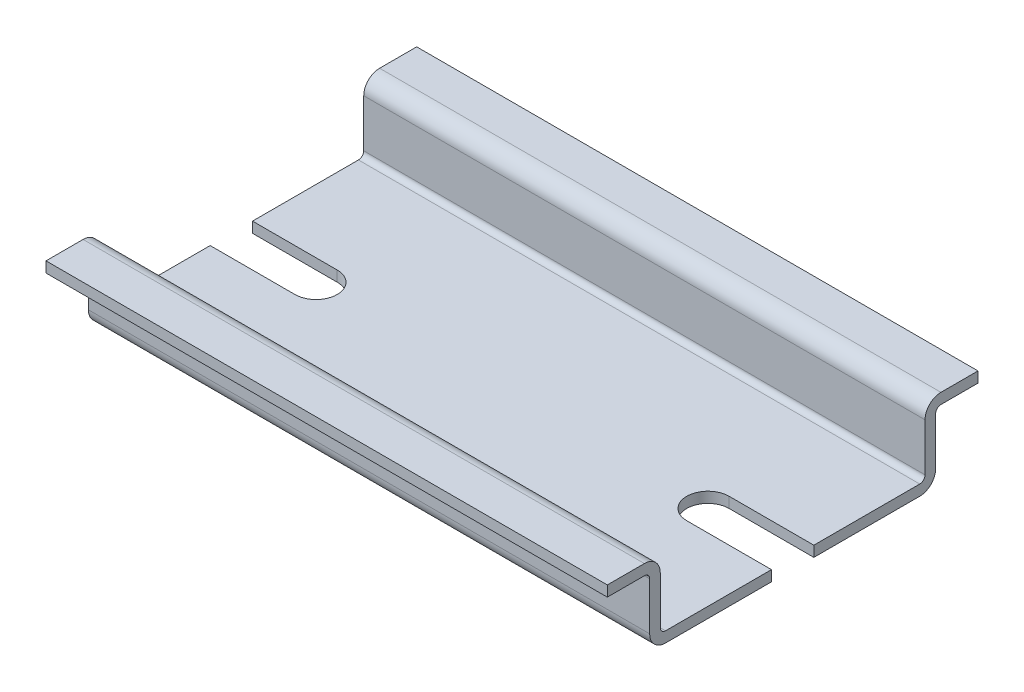
ISO-10303-21;
HEADER;
FILE_DESCRIPTION(('STEP AP214'),'2;1');
FILE_NAME('part.step','',(''),(''),'','','');
FILE_SCHEMA(('AUTOMOTIVE_DESIGN { 1 0 10303 214 1 1 1 1 }'));
ENDSEC;
DATA;
#1=APPLICATION_CONTEXT('core data for automotive mechanical design processes');
#2=APPLICATION_PROTOCOL_DEFINITION('international standard','automotive_design',2000,#1);
#3=PRODUCT_CONTEXT('',#1,'mechanical');
#4=PRODUCT('Part','Part','',(#3));
#5=PRODUCT_RELATED_PRODUCT_CATEGORY('part','',(#4));
#6=PRODUCT_DEFINITION_FORMATION('','',#4);
#7=PRODUCT_DEFINITION_CONTEXT('part definition',#1,'design');
#8=PRODUCT_DEFINITION('design','',#6,#7);
#9=PRODUCT_DEFINITION_SHAPE('','',#8);
#10=(LENGTH_UNIT() NAMED_UNIT(*) SI_UNIT(.MILLI.,.METRE.));
#11=(NAMED_UNIT(*) PLANE_ANGLE_UNIT() SI_UNIT($,.RADIAN.));
#12=(NAMED_UNIT(*) SI_UNIT($,.STERADIAN.) SOLID_ANGLE_UNIT());
#13=UNCERTAINTY_MEASURE_WITH_UNIT(LENGTH_MEASURE(1.E-05),#10,'distance_accuracy_value','');
#14=(GEOMETRIC_REPRESENTATION_CONTEXT(3) GLOBAL_UNCERTAINTY_ASSIGNED_CONTEXT((#13)) GLOBAL_UNIT_ASSIGNED_CONTEXT((#10,
#11,#12)) REPRESENTATION_CONTEXT('',''));
#15=CARTESIAN_POINT('',(0.,0.,0.));
#16=DIRECTION('',(0.,0.,1.));
#17=DIRECTION('',(1.,0.,0.));
#18=AXIS2_PLACEMENT_3D('',#15,#16,#17);
#19=CARTESIAN_POINT('',(26.5,0.,0.));
#20=DIRECTION('',(0.,1.,0.));
#21=DIRECTION('',(0.,0.,1.));
#22=AXIS2_PLACEMENT_3D('',#19,#20,#21);
#23=PLANE('',#22);
#24=DIRECTION('',(1.,0.,0.));
#25=VECTOR('',#24,1.);
#26=CARTESIAN_POINT('',(18.5,0.,-2.));
#27=LINE('',#26,#25);
#28=CARTESIAN_POINT('',(18.5,0.,-2.));
#29=VERTEX_POINT('',#28);
#30=CARTESIAN_POINT('',(26.5,0.,-2.));
#31=VERTEX_POINT('',#30);
#32=EDGE_CURVE('E55',#29,#31,#27,.T.);
#33=ORIENTED_EDGE('',*,*,#32,.F.);
#34=CARTESIAN_POINT('',(18.5,0.,0.));
#35=DIRECTION('',(0.,1.,0.));
#36=DIRECTION('',(0.,0.,1.));
#37=AXIS2_PLACEMENT_3D('',#34,#35,#36);
#38=CIRCLE('',#37,2.);
#39=CARTESIAN_POINT('',(18.5,0.,2.));
#40=VERTEX_POINT('',#39);
#41=EDGE_CURVE('E226',#29,#40,#38,.T.);
#42=ORIENTED_EDGE('',*,*,#41,.T.);
#43=DIRECTION('',(1.,0.,0.));
#44=VECTOR('',#43,1.);
#45=CARTESIAN_POINT('',(18.5,0.,2.));
#46=LINE('',#45,#44);
#47=CARTESIAN_POINT('',(26.5,0.,2.));
#48=VERTEX_POINT('',#47);
#49=EDGE_CURVE('E236',#40,#48,#46,.T.);
#50=ORIENTED_EDGE('',*,*,#49,.T.);
#51=DIRECTION('',(0.,0.,-1.));
#52=VECTOR('',#51,1.);
#53=CARTESIAN_POINT('',(26.5,0.,0.));
#54=LINE('',#53,#52);
#55=CARTESIAN_POINT('',(26.5,0.,12.));
#56=VERTEX_POINT('',#55);
#57=EDGE_CURVE('E454',#56,#48,#54,.T.);
#58=ORIENTED_EDGE('',*,*,#57,.F.);
#59=DIRECTION('',(-1.,0.,0.));
#60=VECTOR('',#59,1.);
#61=CARTESIAN_POINT('',(26.5,0.,12.));
#62=LINE('',#61,#60);
#63=CARTESIAN_POINT('',(-26.5,0.,12.));
#64=VERTEX_POINT('',#63);
#65=EDGE_CURVE('E11',#56,#64,#62,.T.);
#66=ORIENTED_EDGE('',*,*,#65,.T.);
#67=DIRECTION('',(0.,0.,-1.));
#68=VECTOR('',#67,1.);
#69=CARTESIAN_POINT('',(-26.5,0.,0.));
#70=LINE('',#69,#68);
#71=CARTESIAN_POINT('',(-26.5,0.,2.));
#72=VERTEX_POINT('',#71);
#73=EDGE_CURVE('E433',#64,#72,#70,.T.);
#74=ORIENTED_EDGE('',*,*,#73,.T.);
#75=DIRECTION('',(-1.,0.,0.));
#76=VECTOR('',#75,1.);
#77=CARTESIAN_POINT('',(-18.5,0.,2.));
#78=LINE('',#77,#76);
#79=CARTESIAN_POINT('',(-18.5,0.,2.));
#80=VERTEX_POINT('',#79);
#81=EDGE_CURVE('E375',#80,#72,#78,.T.);
#82=ORIENTED_EDGE('',*,*,#81,.F.);
#83=CARTESIAN_POINT('',(-18.5,0.,0.));
#84=DIRECTION('',(0.,-1.,0.));
#85=DIRECTION('',(0.,0.,1.));
#86=AXIS2_PLACEMENT_3D('',#83,#84,#85);
#87=CIRCLE('',#86,2.);
#88=CARTESIAN_POINT('',(-18.5,0.,-2.));
#89=VERTEX_POINT('',#88);
#90=EDGE_CURVE('E378',#89,#80,#87,.T.);
#91=ORIENTED_EDGE('',*,*,#90,.F.);
#92=DIRECTION('',(-1.,0.,0.));
#93=VECTOR('',#92,1.);
#94=CARTESIAN_POINT('',(-18.5,0.,-2.));
#95=LINE('',#94,#93);
#96=CARTESIAN_POINT('',(-26.5,0.,-2.));
#97=VERTEX_POINT('',#96);
#98=EDGE_CURVE('E296',#89,#97,#95,.T.);
#99=ORIENTED_EDGE('',*,*,#98,.T.);
#100=DIRECTION('',(0.,0.,1.));
#101=VECTOR('',#100,1.);
#102=CARTESIAN_POINT('',(-26.5,0.,0.));
#103=LINE('',#102,#101);
#104=CARTESIAN_POINT('',(-26.5,0.,-12.));
#105=VERTEX_POINT('',#104);
#106=EDGE_CURVE('E312',#105,#97,#103,.T.);
#107=ORIENTED_EDGE('',*,*,#106,.F.);
#108=DIRECTION('',(1.,0.,0.));
#109=VECTOR('',#108,1.);
#110=CARTESIAN_POINT('',(-26.5,0.,-12.));
#111=LINE('',#110,#109);
#112=CARTESIAN_POINT('',(26.5,0.,-12.));
#113=VERTEX_POINT('',#112);
#114=EDGE_CURVE('E371',#105,#113,#111,.T.);
#115=ORIENTED_EDGE('',*,*,#114,.T.);
#116=DIRECTION('',(0.,0.,1.));
#117=VECTOR('',#116,1.);
#118=CARTESIAN_POINT('',(26.5,0.,0.));
#119=LINE('',#118,#117);
#120=EDGE_CURVE('E248',#113,#31,#119,.T.);
#121=ORIENTED_EDGE('',*,*,#120,.T.);
#122=EDGE_LOOP('',(#33,#42,#50,#58,#66,#74,#82,#91,#99,#107,#115,#121));
#123=FACE_BOUND('',#122,.T.);
#124=ADVANCED_FACE('F39',(#123),#23,.F.);
#125=CARTESIAN_POINT('',(26.5,0.999999999999996,12.));
#126=DIRECTION('',(0.,-1.,0.));
#127=DIRECTION('',(0.,0.,-1.));
#128=AXIS2_PLACEMENT_3D('',#125,#126,#127);
#129=PLANE('',#128);
#130=CARTESIAN_POINT('',(18.5,0.999999999999995,0.));
#131=DIRECTION('',(0.,1.,0.));
#132=DIRECTION('',(0.,0.,1.));
#133=AXIS2_PLACEMENT_3D('',#130,#131,#132);
#134=CIRCLE('',#133,2.);
#135=CARTESIAN_POINT('',(18.5,0.999999999999995,-2.));
#136=VERTEX_POINT('',#135);
#137=CARTESIAN_POINT('',(18.5,0.999999999999995,2.));
#138=VERTEX_POINT('',#137);
#139=EDGE_CURVE('E436',#136,#138,#134,.T.);
#140=ORIENTED_EDGE('',*,*,#139,.F.);
#141=DIRECTION('',(1.,0.,0.));
#142=VECTOR('',#141,1.);
#143=CARTESIAN_POINT('',(18.5,0.999999999999995,-2.));
#144=LINE('',#143,#142);
#145=CARTESIAN_POINT('',(26.5,0.999999999999995,-2.));
#146=VERTEX_POINT('',#145);
#147=EDGE_CURVE('E241',#136,#146,#144,.T.);
#148=ORIENTED_EDGE('',*,*,#147,.T.);
#149=DIRECTION('',(0.,0.,-1.));
#150=VECTOR('',#149,1.);
#151=CARTESIAN_POINT('',(26.5,0.999999999999996,-12.));
#152=LINE('',#151,#150);
#153=CARTESIAN_POINT('',(26.5,0.999999999999996,-12.));
#154=VERTEX_POINT('',#153);
#155=EDGE_CURVE('E291',#146,#154,#152,.T.);
#156=ORIENTED_EDGE('',*,*,#155,.T.);
#157=DIRECTION('',(1.,0.,0.));
#158=VECTOR('',#157,1.);
#159=CARTESIAN_POINT('',(-26.5,0.999999999999996,-12.));
#160=LINE('',#159,#158);
#161=CARTESIAN_POINT('',(-26.5,0.999999999999996,-12.));
#162=VERTEX_POINT('',#161);
#163=EDGE_CURVE('E367',#162,#154,#160,.T.);
#164=ORIENTED_EDGE('',*,*,#163,.F.);
#165=DIRECTION('',(0.,0.,-1.));
#166=VECTOR('',#165,1.);
#167=CARTESIAN_POINT('',(-26.5,0.999999999999996,-12.));
#168=LINE('',#167,#166);
#169=CARTESIAN_POINT('',(-26.5,0.999999999999995,-2.));
#170=VERTEX_POINT('',#169);
#171=EDGE_CURVE('E316',#170,#162,#168,.T.);
#172=ORIENTED_EDGE('',*,*,#171,.F.);
#173=DIRECTION('',(-1.,0.,0.));
#174=VECTOR('',#173,1.);
#175=CARTESIAN_POINT('',(-18.5,0.999999999999995,-2.));
#176=LINE('',#175,#174);
#177=CARTESIAN_POINT('',(-18.5,0.999999999999995,-2.));
#178=VERTEX_POINT('',#177);
#179=EDGE_CURVE('E63',#178,#170,#176,.T.);
#180=ORIENTED_EDGE('',*,*,#179,.F.);
#181=CARTESIAN_POINT('',(-18.5,0.999999999999995,0.));
#182=DIRECTION('',(0.,-1.,0.));
#183=DIRECTION('',(0.,0.,1.));
#184=AXIS2_PLACEMENT_3D('',#181,#182,#183);
#185=CIRCLE('',#184,2.);
#186=CARTESIAN_POINT('',(-18.5,0.999999999999995,2.));
#187=VERTEX_POINT('',#186);
#188=EDGE_CURVE('E379',#178,#187,#185,.T.);
#189=ORIENTED_EDGE('',*,*,#188,.T.);
#190=DIRECTION('',(-1.,0.,0.));
#191=VECTOR('',#190,1.);
#192=CARTESIAN_POINT('',(-18.5,0.999999999999995,2.));
#193=LINE('',#192,#191);
#194=CARTESIAN_POINT('',(-26.5,0.999999999999995,2.));
#195=VERTEX_POINT('',#194);
#196=EDGE_CURVE('E374',#187,#195,#193,.T.);
#197=ORIENTED_EDGE('',*,*,#196,.T.);
#198=DIRECTION('',(0.,0.,1.));
#199=VECTOR('',#198,1.);
#200=CARTESIAN_POINT('',(-26.5,0.999999999999996,12.));
#201=LINE('',#200,#199);
#202=CARTESIAN_POINT('',(-26.5,0.999999999999996,12.));
#203=VERTEX_POINT('',#202);
#204=EDGE_CURVE('E430',#195,#203,#201,.T.);
#205=ORIENTED_EDGE('',*,*,#204,.T.);
#206=DIRECTION('',(-1.,0.,0.));
#207=VECTOR('',#206,1.);
#208=CARTESIAN_POINT('',(26.5,0.999999999999996,12.));
#209=LINE('',#208,#207);
#210=CARTESIAN_POINT('',(26.5,0.999999999999996,12.));
#211=VERTEX_POINT('',#210);
#212=EDGE_CURVE('E48',#211,#203,#209,.T.);
#213=ORIENTED_EDGE('',*,*,#212,.F.);
#214=DIRECTION('',(0.,0.,1.));
#215=VECTOR('',#214,1.);
#216=CARTESIAN_POINT('',(26.5,0.999999999999996,12.));
#217=LINE('',#216,#215);
#218=CARTESIAN_POINT('',(26.5,0.999999999999995,2.));
#219=VERTEX_POINT('',#218);
#220=EDGE_CURVE('E458',#219,#211,#217,.T.);
#221=ORIENTED_EDGE('',*,*,#220,.F.);
#222=DIRECTION('',(1.,0.,0.));
#223=VECTOR('',#222,1.);
#224=CARTESIAN_POINT('',(18.5,0.999999999999995,2.));
#225=LINE('',#224,#223);
#226=EDGE_CURVE('E237',#138,#219,#225,.T.);
#227=ORIENTED_EDGE('',*,*,#226,.F.);
#228=EDGE_LOOP('',(#140,#148,#156,#164,#172,#180,#189,#197,#205,#213,#221,#227));
#229=FACE_BOUND('',#228,.T.);
#230=ADVANCED_FACE('F534',(#229),#129,.F.);
#231=CARTESIAN_POINT('',(26.5,1.5,-12.));
#232=DIRECTION('',(-1.,0.,0.));
#233=DIRECTION('',(0.,0.,-1.));
#234=AXIS2_PLACEMENT_3D('',#231,#232,#233);
#235=PLANE('',#234);
#236=DIRECTION('',(0.,1.,0.));
#237=VECTOR('',#236,1.);
#238=CARTESIAN_POINT('',(26.5,0.,-2.));
#239=LINE('',#238,#237);
#240=EDGE_CURVE('E244',#31,#146,#239,.T.);
#241=ORIENTED_EDGE('',*,*,#240,.F.);
#242=ORIENTED_EDGE('',*,*,#120,.F.);
#243=CARTESIAN_POINT('',(26.5,1.5,-12.));
#244=DIRECTION('',(-1.,0.,0.));
#245=DIRECTION('',(0.,0.,-1.));
#246=AXIS2_PLACEMENT_3D('',#243,#244,#245);
#247=CIRCLE('',#246,1.5);
#248=CARTESIAN_POINT('',(26.5,1.5,-13.5));
#249=VERTEX_POINT('',#248);
#250=EDGE_CURVE('E243',#249,#113,#247,.T.);
#251=ORIENTED_EDGE('',*,*,#250,.F.);
#252=DIRECTION('',(0.,-1.,0.));
#253=VECTOR('',#252,1.);
#254=CARTESIAN_POINT('',(26.5,1.5,-13.5));
#255=LINE('',#254,#253);
#256=CARTESIAN_POINT('',(26.5,6.,-13.5));
#257=VERTEX_POINT('',#256);
#258=EDGE_CURVE('E259',#257,#249,#255,.T.);
#259=ORIENTED_EDGE('',*,*,#258,.F.);
#260=CARTESIAN_POINT('',(26.5,6.,-14.));
#261=DIRECTION('',(1.,0.,0.));
#262=DIRECTION('',(0.,0.,1.));
#263=AXIS2_PLACEMENT_3D('',#260,#261,#262);
#264=CIRCLE('',#263,0.5);
#265=CARTESIAN_POINT('',(26.5,6.5,-14.));
#266=VERTEX_POINT('',#265);
#267=EDGE_CURVE('E263',#266,#257,#264,.T.);
#268=ORIENTED_EDGE('',*,*,#267,.F.);
#269=DIRECTION('',(0.,0.,1.));
#270=VECTOR('',#269,1.);
#271=CARTESIAN_POINT('',(26.5,6.5,-14.));
#272=LINE('',#271,#270);
#273=CARTESIAN_POINT('',(26.5,6.5,-17.5));
#274=VERTEX_POINT('',#273);
#275=EDGE_CURVE('E267',#274,#266,#272,.T.);
#276=ORIENTED_EDGE('',*,*,#275,.F.);
#277=DIRECTION('',(0.,-1.,0.));
#278=VECTOR('',#277,1.);
#279=CARTESIAN_POINT('',(26.5,6.5,-17.5));
#280=LINE('',#279,#278);
#281=CARTESIAN_POINT('',(26.5,7.5,-17.5));
#282=VERTEX_POINT('',#281);
#283=EDGE_CURVE('E271',#282,#274,#280,.T.);
#284=ORIENTED_EDGE('',*,*,#283,.F.);
#285=DIRECTION('',(0.,0.,-1.));
#286=VECTOR('',#285,1.);
#287=CARTESIAN_POINT('',(26.5,7.5,-14.));
#288=LINE('',#287,#286);
#289=CARTESIAN_POINT('',(26.5,7.5,-14.));
#290=VERTEX_POINT('',#289);
#291=EDGE_CURVE('E275',#290,#282,#288,.T.);
#292=ORIENTED_EDGE('',*,*,#291,.F.);
#293=CARTESIAN_POINT('',(26.5,6.,-14.));
#294=DIRECTION('',(-1.,0.,0.));
#295=DIRECTION('',(0.,0.,1.));
#296=AXIS2_PLACEMENT_3D('',#293,#294,#295);
#297=CIRCLE('',#296,1.5);
#298=CARTESIAN_POINT('',(26.5,6.,-12.5));
#299=VERTEX_POINT('',#298);
#300=EDGE_CURVE('E279',#299,#290,#297,.T.);
#301=ORIENTED_EDGE('',*,*,#300,.F.);
#302=DIRECTION('',(0.,1.,0.));
#303=VECTOR('',#302,1.);
#304=CARTESIAN_POINT('',(26.5,1.5,-12.5));
#305=LINE('',#304,#303);
#306=CARTESIAN_POINT('',(26.5,1.5,-12.5));
#307=VERTEX_POINT('',#306);
#308=EDGE_CURVE('E283',#307,#299,#305,.T.);
#309=ORIENTED_EDGE('',*,*,#308,.F.);
#310=CARTESIAN_POINT('',(26.5,1.5,-12.));
#311=DIRECTION('',(1.,0.,0.));
#312=DIRECTION('',(0.,0.,1.));
#313=AXIS2_PLACEMENT_3D('',#310,#311,#312);
#314=CIRCLE('',#313,0.5);
#315=EDGE_CURVE('E287',#154,#307,#314,.T.);
#316=ORIENTED_EDGE('',*,*,#315,.F.);
#317=ORIENTED_EDGE('',*,*,#155,.F.);
#318=EDGE_LOOP('',(#241,#242,#251,#259,#268,#276,#284,#292,#301,#309,#316,#317));
#319=FACE_BOUND('',#318,.T.);
#320=ADVANCED_FACE('F567',(#319),#235,.F.);
#321=CARTESIAN_POINT('',(-26.5,1.5,12.));
#322=DIRECTION('',(1.,0.,0.));
#323=DIRECTION('',(0.,0.,1.));
#324=AXIS2_PLACEMENT_3D('',#321,#322,#323);
#325=PLANE('',#324);
#326=DIRECTION('',(0.,1.,0.));
#327=VECTOR('',#326,1.);
#328=CARTESIAN_POINT('',(-26.5,0.,2.));
#329=LINE('',#328,#327);
#330=EDGE_CURVE('E382',#72,#195,#329,.T.);
#331=ORIENTED_EDGE('',*,*,#330,.F.);
#332=ORIENTED_EDGE('',*,*,#73,.F.);
#333=CARTESIAN_POINT('',(-26.5,1.5,12.));
#334=DIRECTION('',(1.,0.,0.));
#335=DIRECTION('',(0.,0.,1.));
#336=AXIS2_PLACEMENT_3D('',#333,#334,#335);
#337=CIRCLE('',#336,1.5);
#338=CARTESIAN_POINT('',(-26.5,1.5,13.5));
#339=VERTEX_POINT('',#338);
#340=EDGE_CURVE('E392',#339,#64,#337,.T.);
#341=ORIENTED_EDGE('',*,*,#340,.F.);
#342=DIRECTION('',(0.,-1.,0.));
#343=VECTOR('',#342,1.);
#344=CARTESIAN_POINT('',(-26.5,1.5,13.5));
#345=LINE('',#344,#343);
#346=CARTESIAN_POINT('',(-26.5,6.,13.5));
#347=VERTEX_POINT('',#346);
#348=EDGE_CURVE('E398',#347,#339,#345,.T.);
#349=ORIENTED_EDGE('',*,*,#348,.F.);
#350=CARTESIAN_POINT('',(-26.5,6.,14.));
#351=DIRECTION('',(-1.,0.,0.));
#352=DIRECTION('',(0.,0.,-1.));
#353=AXIS2_PLACEMENT_3D('',#350,#351,#352);
#354=CIRCLE('',#353,0.5);
#355=CARTESIAN_POINT('',(-26.5,6.5,14.));
#356=VERTEX_POINT('',#355);
#357=EDGE_CURVE('E402',#356,#347,#354,.T.);
#358=ORIENTED_EDGE('',*,*,#357,.F.);
#359=DIRECTION('',(0.,0.,-1.));
#360=VECTOR('',#359,1.);
#361=CARTESIAN_POINT('',(-26.5,6.5,14.));
#362=LINE('',#361,#360);
#363=CARTESIAN_POINT('',(-26.5,6.5,17.5));
#364=VERTEX_POINT('',#363);
#365=EDGE_CURVE('E406',#364,#356,#362,.T.);
#366=ORIENTED_EDGE('',*,*,#365,.F.);
#367=DIRECTION('',(0.,-1.,0.));
#368=VECTOR('',#367,1.);
#369=CARTESIAN_POINT('',(-26.5,6.5,17.5));
#370=LINE('',#369,#368);
#371=CARTESIAN_POINT('',(-26.5,7.5,17.5));
#372=VERTEX_POINT('',#371);
#373=EDGE_CURVE('E410',#372,#364,#370,.T.);
#374=ORIENTED_EDGE('',*,*,#373,.F.);
#375=DIRECTION('',(0.,0.,1.));
#376=VECTOR('',#375,1.);
#377=CARTESIAN_POINT('',(-26.5,7.5,14.));
#378=LINE('',#377,#376);
#379=CARTESIAN_POINT('',(-26.5,7.5,14.));
#380=VERTEX_POINT('',#379);
#381=EDGE_CURVE('E414',#380,#372,#378,.T.);
#382=ORIENTED_EDGE('',*,*,#381,.F.);
#383=CARTESIAN_POINT('',(-26.5,6.,14.));
#384=DIRECTION('',(1.,0.,0.));
#385=DIRECTION('',(0.,0.,-1.));
#386=AXIS2_PLACEMENT_3D('',#383,#384,#385);
#387=CIRCLE('',#386,1.5);
#388=CARTESIAN_POINT('',(-26.5,6.,12.5));
#389=VERTEX_POINT('',#388);
#390=EDGE_CURVE('E418',#389,#380,#387,.T.);
#391=ORIENTED_EDGE('',*,*,#390,.F.);
#392=DIRECTION('',(0.,1.,0.));
#393=VECTOR('',#392,1.);
#394=CARTESIAN_POINT('',(-26.5,1.5,12.5));
#395=LINE('',#394,#393);
#396=CARTESIAN_POINT('',(-26.5,1.5,12.5));
#397=VERTEX_POINT('',#396);
#398=EDGE_CURVE('E422',#397,#389,#395,.T.);
#399=ORIENTED_EDGE('',*,*,#398,.F.);
#400=CARTESIAN_POINT('',(-26.5,1.5,12.));
#401=DIRECTION('',(-1.,0.,0.));
#402=DIRECTION('',(0.,0.,-1.));
#403=AXIS2_PLACEMENT_3D('',#400,#401,#402);
#404=CIRCLE('',#403,0.5);
#405=EDGE_CURVE('E426',#203,#397,#404,.T.);
#406=ORIENTED_EDGE('',*,*,#405,.F.);
#407=ORIENTED_EDGE('',*,*,#204,.F.);
#408=EDGE_LOOP('',(#331,#332,#341,#349,#358,#366,#374,#382,#391,#399,#406,#407));
#409=FACE_BOUND('',#408,.T.);
#410=ADVANCED_FACE('F522',(#409),#325,.F.);
#411=CARTESIAN_POINT('',(26.5,1.5,12.));
#412=DIRECTION('',(-1.,0.,0.));
#413=DIRECTION('',(0.,0.,1.));
#414=AXIS2_PLACEMENT_3D('',#411,#412,#413);
#415=CYLINDRICAL_SURFACE('',#414,1.5);
#416=DIRECTION('',(-1.,0.,0.));
#417=VECTOR('',#416,1.);
#418=CARTESIAN_POINT('',(26.5,1.5,13.5));
#419=LINE('',#418,#417);
#420=CARTESIAN_POINT('',(26.5,1.5,13.5));
#421=VERTEX_POINT('',#420);
#422=EDGE_CURVE('E485',#421,#339,#419,.T.);
#423=ORIENTED_EDGE('',*,*,#422,.T.);
#424=ORIENTED_EDGE('',*,*,#340,.T.);
#425=ORIENTED_EDGE('',*,*,#65,.F.);
#426=CARTESIAN_POINT('',(26.5,1.5,12.));
#427=DIRECTION('',(1.,0.,0.));
#428=DIRECTION('',(0.,0.,1.));
#429=AXIS2_PLACEMENT_3D('',#426,#427,#428);
#430=CIRCLE('',#429,1.5);
#431=EDGE_CURVE('E448',#421,#56,#430,.T.);
#432=ORIENTED_EDGE('',*,*,#431,.F.);
#433=EDGE_LOOP('',(#423,#424,#425,#432));
#434=FACE_BOUND('',#433,.T.);
#435=ADVANCED_FACE('F41',(#434),#415,.T.);
#436=CARTESIAN_POINT('',(26.5,1.5,12.));
#437=DIRECTION('',(-1.,0.,0.));
#438=DIRECTION('',(0.,0.,1.));
#439=AXIS2_PLACEMENT_3D('',#436,#437,#438);
#440=CYLINDRICAL_SURFACE('',#439,0.5);
#441=ORIENTED_EDGE('',*,*,#212,.T.);
#442=ORIENTED_EDGE('',*,*,#405,.T.);
#443=DIRECTION('',(-1.,0.,0.));
#444=VECTOR('',#443,1.);
#445=CARTESIAN_POINT('',(26.5,1.5,12.5));
#446=LINE('',#445,#444);
#447=CARTESIAN_POINT('',(26.5,1.5,12.5));
#448=VERTEX_POINT('',#447);
#449=EDGE_CURVE('E506',#448,#397,#446,.T.);
#450=ORIENTED_EDGE('',*,*,#449,.F.);
#451=CARTESIAN_POINT('',(26.5,1.5,12.));
#452=DIRECTION('',(-1.,0.,0.));
#453=DIRECTION('',(0.,0.,-1.));
#454=AXIS2_PLACEMENT_3D('',#451,#452,#453);
#455=CIRCLE('',#454,0.5);
#456=EDGE_CURVE('E461',#211,#448,#455,.T.);
#457=ORIENTED_EDGE('',*,*,#456,.F.);
#458=EDGE_LOOP('',(#441,#442,#450,#457));
#459=FACE_BOUND('',#458,.T.);
#460=ADVANCED_FACE('F514',(#459),#440,.F.);
#461=CARTESIAN_POINT('',(26.5,1.5,12.5));
#462=DIRECTION('',(0.,0.,1.));
#463=DIRECTION('',(0.,-1.,0.));
#464=AXIS2_PLACEMENT_3D('',#461,#462,#463);
#465=PLANE('',#464);
#466=ORIENTED_EDGE('',*,*,#449,.T.);
#467=ORIENTED_EDGE('',*,*,#398,.T.);
#468=DIRECTION('',(-1.,0.,0.));
#469=VECTOR('',#468,1.);
#470=CARTESIAN_POINT('',(26.5,6.,12.5));
#471=LINE('',#470,#469);
#472=CARTESIAN_POINT('',(26.5,6.,12.5));
#473=VERTEX_POINT('',#472);
#474=EDGE_CURVE('E503',#473,#389,#471,.T.);
#475=ORIENTED_EDGE('',*,*,#474,.F.);
#476=DIRECTION('',(0.,1.,0.));
#477=VECTOR('',#476,1.);
#478=CARTESIAN_POINT('',(26.5,1.5,12.5));
#479=LINE('',#478,#477);
#480=EDGE_CURVE('E464',#448,#473,#479,.T.);
#481=ORIENTED_EDGE('',*,*,#480,.F.);
#482=EDGE_LOOP('',(#466,#467,#475,#481));
#483=FACE_BOUND('',#482,.T.);
#484=ADVANCED_FACE('F527',(#483),#465,.F.);
#485=CARTESIAN_POINT('',(26.5,6.,14.));
#486=DIRECTION('',(-1.,0.,0.));
#487=DIRECTION('',(0.,0.,1.));
#488=AXIS2_PLACEMENT_3D('',#485,#486,#487);
#489=CYLINDRICAL_SURFACE('',#488,1.5);
#490=ORIENTED_EDGE('',*,*,#474,.T.);
#491=ORIENTED_EDGE('',*,*,#390,.T.);
#492=DIRECTION('',(-1.,0.,0.));
#493=VECTOR('',#492,1.);
#494=CARTESIAN_POINT('',(26.5,7.5,14.));
#495=LINE('',#494,#493);
#496=CARTESIAN_POINT('',(26.5,7.5,14.));
#497=VERTEX_POINT('',#496);
#498=EDGE_CURVE('E500',#497,#380,#495,.T.);
#499=ORIENTED_EDGE('',*,*,#498,.F.);
#500=CARTESIAN_POINT('',(26.5,6.,14.));
#501=DIRECTION('',(1.,0.,0.));
#502=DIRECTION('',(0.,0.,-1.));
#503=AXIS2_PLACEMENT_3D('',#500,#501,#502);
#504=CIRCLE('',#503,1.5);
#505=EDGE_CURVE('E467',#473,#497,#504,.T.);
#506=ORIENTED_EDGE('',*,*,#505,.F.);
#507=EDGE_LOOP('',(#490,#491,#499,#506));
#508=FACE_BOUND('',#507,.T.);
#509=ADVANCED_FACE('F625',(#508),#489,.T.);
#510=CARTESIAN_POINT('',(26.5,7.5,14.));
#511=DIRECTION('',(0.,-1.,0.));
#512=DIRECTION('',(0.,0.,-1.));
#513=AXIS2_PLACEMENT_3D('',#510,#511,#512);
#514=PLANE('',#513);
#515=ORIENTED_EDGE('',*,*,#498,.T.);
#516=ORIENTED_EDGE('',*,*,#381,.T.);
#517=DIRECTION('',(-1.,0.,0.));
#518=VECTOR('',#517,1.);
#519=CARTESIAN_POINT('',(26.5,7.5,17.5));
#520=LINE('',#519,#518);
#521=CARTESIAN_POINT('',(26.5,7.5,17.5));
#522=VERTEX_POINT('',#521);
#523=EDGE_CURVE('E497',#522,#372,#520,.T.);
#524=ORIENTED_EDGE('',*,*,#523,.F.);
#525=DIRECTION('',(0.,0.,1.));
#526=VECTOR('',#525,1.);
#527=CARTESIAN_POINT('',(26.5,7.5,14.));
#528=LINE('',#527,#526);
#529=EDGE_CURVE('E470',#497,#522,#528,.T.);
#530=ORIENTED_EDGE('',*,*,#529,.F.);
#531=EDGE_LOOP('',(#515,#516,#524,#530));
#532=FACE_BOUND('',#531,.T.);
#533=ADVANCED_FACE('F628',(#532),#514,.F.);
#534=CARTESIAN_POINT('',(26.5,6.5,17.5));
#535=DIRECTION('',(0.,0.,-1.));
#536=DIRECTION('',(0.,1.,0.));
#537=AXIS2_PLACEMENT_3D('',#534,#535,#536);
#538=PLANE('',#537);
#539=ORIENTED_EDGE('',*,*,#523,.T.);
#540=ORIENTED_EDGE('',*,*,#373,.T.);
#541=DIRECTION('',(-1.,0.,0.));
#542=VECTOR('',#541,1.);
#543=CARTESIAN_POINT('',(26.5,6.5,17.5));
#544=LINE('',#543,#542);
#545=CARTESIAN_POINT('',(26.5,6.5,17.5));
#546=VERTEX_POINT('',#545);
#547=EDGE_CURVE('E494',#546,#364,#544,.T.);
#548=ORIENTED_EDGE('',*,*,#547,.F.);
#549=DIRECTION('',(0.,-1.,0.));
#550=VECTOR('',#549,1.);
#551=CARTESIAN_POINT('',(26.5,6.5,17.5));
#552=LINE('',#551,#550);
#553=EDGE_CURVE('E473',#522,#546,#552,.T.);
#554=ORIENTED_EDGE('',*,*,#553,.F.);
#555=EDGE_LOOP('',(#539,#540,#548,#554));
#556=FACE_BOUND('',#555,.T.);
#557=ADVANCED_FACE('F632',(#556),#538,.F.);
#558=CARTESIAN_POINT('',(26.5,6.5,14.));
#559=DIRECTION('',(0.,1.,0.));
#560=DIRECTION('',(0.,0.,1.));
#561=AXIS2_PLACEMENT_3D('',#558,#559,#560);
#562=PLANE('',#561);
#563=ORIENTED_EDGE('',*,*,#547,.T.);
#564=ORIENTED_EDGE('',*,*,#365,.T.);
#565=DIRECTION('',(-1.,0.,0.));
#566=VECTOR('',#565,1.);
#567=CARTESIAN_POINT('',(26.5,6.5,14.));
#568=LINE('',#567,#566);
#569=CARTESIAN_POINT('',(26.5,6.5,14.));
#570=VERTEX_POINT('',#569);
#571=EDGE_CURVE('E491',#570,#356,#568,.T.);
#572=ORIENTED_EDGE('',*,*,#571,.F.);
#573=DIRECTION('',(0.,0.,-1.));
#574=VECTOR('',#573,1.);
#575=CARTESIAN_POINT('',(26.5,6.5,14.));
#576=LINE('',#575,#574);
#577=EDGE_CURVE('E476',#546,#570,#576,.T.);
#578=ORIENTED_EDGE('',*,*,#577,.F.);
#579=EDGE_LOOP('',(#563,#564,#572,#578));
#580=FACE_BOUND('',#579,.T.);
#581=ADVANCED_FACE('F636',(#580),#562,.F.);
#582=CARTESIAN_POINT('',(26.5,6.,14.));
#583=DIRECTION('',(-1.,0.,0.));
#584=DIRECTION('',(0.,0.,1.));
#585=AXIS2_PLACEMENT_3D('',#582,#583,#584);
#586=CYLINDRICAL_SURFACE('',#585,0.5);
#587=ORIENTED_EDGE('',*,*,#571,.T.);
#588=ORIENTED_EDGE('',*,*,#357,.T.);
#589=DIRECTION('',(-1.,0.,0.));
#590=VECTOR('',#589,1.);
#591=CARTESIAN_POINT('',(26.5,6.,13.5));
#592=LINE('',#591,#590);
#593=CARTESIAN_POINT('',(26.5,6.,13.5));
#594=VERTEX_POINT('',#593);
#595=EDGE_CURVE('E488',#594,#347,#592,.T.);
#596=ORIENTED_EDGE('',*,*,#595,.F.);
#597=CARTESIAN_POINT('',(26.5,6.,14.));
#598=DIRECTION('',(-1.,0.,0.));
#599=DIRECTION('',(0.,0.,-1.));
#600=AXIS2_PLACEMENT_3D('',#597,#598,#599);
#601=CIRCLE('',#600,0.5);
#602=EDGE_CURVE('E479',#570,#594,#601,.T.);
#603=ORIENTED_EDGE('',*,*,#602,.F.);
#604=EDGE_LOOP('',(#587,#588,#596,#603));
#605=FACE_BOUND('',#604,.T.);
#606=ADVANCED_FACE('F640',(#605),#586,.F.);
#607=CARTESIAN_POINT('',(26.5,1.5,13.5));
#608=DIRECTION('',(0.,0.,-1.));
#609=DIRECTION('',(0.,1.,0.));
#610=AXIS2_PLACEMENT_3D('',#607,#608,#609);
#611=PLANE('',#610);
#612=ORIENTED_EDGE('',*,*,#595,.T.);
#613=ORIENTED_EDGE('',*,*,#348,.T.);
#614=ORIENTED_EDGE('',*,*,#422,.F.);
#615=DIRECTION('',(0.,-1.,0.));
#616=VECTOR('',#615,1.);
#617=CARTESIAN_POINT('',(26.5,1.5,13.5));
#618=LINE('',#617,#616);
#619=EDGE_CURVE('E482',#594,#421,#618,.T.);
#620=ORIENTED_EDGE('',*,*,#619,.F.);
#621=EDGE_LOOP('',(#612,#613,#614,#620));
#622=FACE_BOUND('',#621,.T.);
#623=ADVANCED_FACE('F644',(#622),#611,.F.);
#624=CARTESIAN_POINT('',(26.5,1.5,12.));
#625=DIRECTION('',(-1.,0.,0.));
#626=DIRECTION('',(0.,0.,1.));
#627=AXIS2_PLACEMENT_3D('',#624,#625,#626);
#628=PLANE('',#627);
#629=ORIENTED_EDGE('',*,*,#57,.T.);
#630=DIRECTION('',(0.,1.,0.));
#631=VECTOR('',#630,1.);
#632=CARTESIAN_POINT('',(26.5,0.,2.));
#633=LINE('',#632,#631);
#634=EDGE_CURVE('E444',#48,#219,#633,.T.);
#635=ORIENTED_EDGE('',*,*,#634,.T.);
#636=ORIENTED_EDGE('',*,*,#220,.T.);
#637=ORIENTED_EDGE('',*,*,#456,.T.);
#638=ORIENTED_EDGE('',*,*,#480,.T.);
#639=ORIENTED_EDGE('',*,*,#505,.T.);
#640=ORIENTED_EDGE('',*,*,#529,.T.);
#641=ORIENTED_EDGE('',*,*,#553,.T.);
#642=ORIENTED_EDGE('',*,*,#577,.T.);
#643=ORIENTED_EDGE('',*,*,#602,.T.);
#644=ORIENTED_EDGE('',*,*,#619,.T.);
#645=ORIENTED_EDGE('',*,*,#431,.T.);
#646=EDGE_LOOP('',(#629,#635,#636,#637,#638,#639,#640,#641,#642,#643,#644,#645));
#647=FACE_BOUND('',#646,.T.);
#648=ADVANCED_FACE('F531',(#647),#628,.F.);
#649=CARTESIAN_POINT('',(18.5,0.,2.));
#650=DIRECTION('',(0.,0.,1.));
#651=DIRECTION('',(0.,-1.,0.));
#652=AXIS2_PLACEMENT_3D('',#649,#650,#651);
#653=PLANE('',#652);
#654=ORIENTED_EDGE('',*,*,#226,.T.);
#655=ORIENTED_EDGE('',*,*,#634,.F.);
#656=ORIENTED_EDGE('',*,*,#49,.F.);
#657=DIRECTION('',(0.,1.,0.));
#658=VECTOR('',#657,1.);
#659=CARTESIAN_POINT('',(18.5,0.,2.));
#660=LINE('',#659,#658);
#661=EDGE_CURVE('E231',#40,#138,#660,.T.);
#662=ORIENTED_EDGE('',*,*,#661,.T.);
#663=EDGE_LOOP('',(#654,#655,#656,#662));
#664=FACE_BOUND('',#663,.T.);
#665=ADVANCED_FACE('F536',(#664),#653,.F.);
#666=CARTESIAN_POINT('',(18.5,0.,0.));
#667=DIRECTION('',(0.,1.,0.));
#668=DIRECTION('',(0.,0.,1.));
#669=AXIS2_PLACEMENT_3D('',#666,#667,#668);
#670=CYLINDRICAL_SURFACE('',#669,2.);
#671=ORIENTED_EDGE('',*,*,#139,.T.);
#672=ORIENTED_EDGE('',*,*,#661,.F.);
#673=ORIENTED_EDGE('',*,*,#41,.F.);
#674=DIRECTION('',(0.,1.,0.));
#675=VECTOR('',#674,1.);
#676=CARTESIAN_POINT('',(18.5,0.,-2.));
#677=LINE('',#676,#675);
#678=EDGE_CURVE('E229',#29,#136,#677,.T.);
#679=ORIENTED_EDGE('',*,*,#678,.T.);
#680=EDGE_LOOP('',(#671,#672,#673,#679));
#681=FACE_BOUND('',#680,.T.);
#682=ADVANCED_FACE('F228',(#681),#670,.F.);
#683=CARTESIAN_POINT('',(-18.5,0.,0.));
#684=DIRECTION('',(0.,1.,0.));
#685=DIRECTION('',(0.,0.,1.));
#686=AXIS2_PLACEMENT_3D('',#683,#684,#685);
#687=CYLINDRICAL_SURFACE('',#686,2.);
#688=ORIENTED_EDGE('',*,*,#188,.F.);
#689=DIRECTION('',(0.,1.,0.));
#690=VECTOR('',#689,1.);
#691=CARTESIAN_POINT('',(-18.5,0.,-2.));
#692=LINE('',#691,#690);
#693=EDGE_CURVE('E300',#89,#178,#692,.T.);
#694=ORIENTED_EDGE('',*,*,#693,.F.);
#695=ORIENTED_EDGE('',*,*,#90,.T.);
#696=DIRECTION('',(0.,1.,0.));
#697=VECTOR('',#696,1.);
#698=CARTESIAN_POINT('',(-18.5,0.,2.));
#699=LINE('',#698,#697);
#700=EDGE_CURVE('E389',#80,#187,#699,.T.);
#701=ORIENTED_EDGE('',*,*,#700,.T.);
#702=EDGE_LOOP('',(#688,#694,#695,#701));
#703=FACE_BOUND('',#702,.T.);
#704=ADVANCED_FACE('F553',(#703),#687,.F.);
#705=CARTESIAN_POINT('',(-18.5,0.,2.));
#706=DIRECTION('',(0.,0.,-1.));
#707=DIRECTION('',(0.,1.,0.));
#708=AXIS2_PLACEMENT_3D('',#705,#706,#707);
#709=PLANE('',#708);
#710=ORIENTED_EDGE('',*,*,#196,.F.);
#711=ORIENTED_EDGE('',*,*,#700,.F.);
#712=ORIENTED_EDGE('',*,*,#81,.T.);
#713=ORIENTED_EDGE('',*,*,#330,.T.);
#714=EDGE_LOOP('',(#710,#711,#712,#713));
#715=FACE_BOUND('',#714,.T.);
#716=ADVANCED_FACE('F548',(#715),#709,.T.);
#717=CARTESIAN_POINT('',(-26.5,1.5,-12.));
#718=DIRECTION('',(1.,0.,0.));
#719=DIRECTION('',(0.,0.,-1.));
#720=AXIS2_PLACEMENT_3D('',#717,#718,#719);
#721=CYLINDRICAL_SURFACE('',#720,1.5);
#722=DIRECTION('',(1.,0.,0.));
#723=VECTOR('',#722,1.);
#724=CARTESIAN_POINT('',(-26.5,1.5,-13.5));
#725=LINE('',#724,#723);
#726=CARTESIAN_POINT('',(-26.5,1.5,-13.5));
#727=VERTEX_POINT('',#726);
#728=EDGE_CURVE('E343',#727,#249,#725,.T.);
#729=ORIENTED_EDGE('',*,*,#728,.T.);
#730=ORIENTED_EDGE('',*,*,#250,.T.);
#731=ORIENTED_EDGE('',*,*,#114,.F.);
#732=CARTESIAN_POINT('',(-26.5,1.5,-12.));
#733=DIRECTION('',(-1.,0.,0.));
#734=DIRECTION('',(0.,0.,-1.));
#735=AXIS2_PLACEMENT_3D('',#732,#733,#734);
#736=CIRCLE('',#735,1.5);
#737=EDGE_CURVE('E306',#727,#105,#736,.T.);
#738=ORIENTED_EDGE('',*,*,#737,.F.);
#739=EDGE_LOOP('',(#729,#730,#731,#738));
#740=FACE_BOUND('',#739,.T.);
#741=ADVANCED_FACE('F563',(#740),#721,.T.);
#742=CARTESIAN_POINT('',(-26.5,1.5,-12.));
#743=DIRECTION('',(1.,0.,0.));
#744=DIRECTION('',(0.,0.,-1.));
#745=AXIS2_PLACEMENT_3D('',#742,#743,#744);
#746=CYLINDRICAL_SURFACE('',#745,0.5);
#747=ORIENTED_EDGE('',*,*,#163,.T.);
#748=ORIENTED_EDGE('',*,*,#315,.T.);
#749=DIRECTION('',(1.,0.,0.));
#750=VECTOR('',#749,1.);
#751=CARTESIAN_POINT('',(-26.5,1.5,-12.5));
#752=LINE('',#751,#750);
#753=CARTESIAN_POINT('',(-26.5,1.5,-12.5));
#754=VERTEX_POINT('',#753);
#755=EDGE_CURVE('E364',#754,#307,#752,.T.);
#756=ORIENTED_EDGE('',*,*,#755,.F.);
#757=CARTESIAN_POINT('',(-26.5,1.5,-12.));
#758=DIRECTION('',(1.,0.,0.));
#759=DIRECTION('',(0.,0.,1.));
#760=AXIS2_PLACEMENT_3D('',#757,#758,#759);
#761=CIRCLE('',#760,0.5);
#762=EDGE_CURVE('E319',#162,#754,#761,.T.);
#763=ORIENTED_EDGE('',*,*,#762,.F.);
#764=EDGE_LOOP('',(#747,#748,#756,#763));
#765=FACE_BOUND('',#764,.T.);
#766=ADVANCED_FACE('F573',(#765),#746,.F.);
#767=CARTESIAN_POINT('',(-26.5,1.5,-12.5));
#768=DIRECTION('',(0.,0.,-1.));
#769=DIRECTION('',(0.,1.,0.));
#770=AXIS2_PLACEMENT_3D('',#767,#768,#769);
#771=PLANE('',#770);
#772=ORIENTED_EDGE('',*,*,#755,.T.);
#773=ORIENTED_EDGE('',*,*,#308,.T.);
#774=DIRECTION('',(1.,0.,0.));
#775=VECTOR('',#774,1.);
#776=CARTESIAN_POINT('',(-26.5,6.,-12.5));
#777=LINE('',#776,#775);
#778=CARTESIAN_POINT('',(-26.5,6.,-12.5));
#779=VERTEX_POINT('',#778);
#780=EDGE_CURVE('E361',#779,#299,#777,.T.);
#781=ORIENTED_EDGE('',*,*,#780,.F.);
#782=DIRECTION('',(0.,1.,0.));
#783=VECTOR('',#782,1.);
#784=CARTESIAN_POINT('',(-26.5,1.5,-12.5));
#785=LINE('',#784,#783);
#786=EDGE_CURVE('E322',#754,#779,#785,.T.);
#787=ORIENTED_EDGE('',*,*,#786,.F.);
#788=EDGE_LOOP('',(#772,#773,#781,#787));
#789=FACE_BOUND('',#788,.T.);
#790=ADVANCED_FACE('F580',(#789),#771,.F.);
#791=CARTESIAN_POINT('',(-26.5,6.,-14.));
#792=DIRECTION('',(1.,0.,0.));
#793=DIRECTION('',(0.,0.,-1.));
#794=AXIS2_PLACEMENT_3D('',#791,#792,#793);
#795=CYLINDRICAL_SURFACE('',#794,1.5);
#796=ORIENTED_EDGE('',*,*,#780,.T.);
#797=ORIENTED_EDGE('',*,*,#300,.T.);
#798=DIRECTION('',(1.,0.,0.));
#799=VECTOR('',#798,1.);
#800=CARTESIAN_POINT('',(-26.5,7.5,-14.));
#801=LINE('',#800,#799);
#802=CARTESIAN_POINT('',(-26.5,7.5,-14.));
#803=VERTEX_POINT('',#802);
#804=EDGE_CURVE('E358',#803,#290,#801,.T.);
#805=ORIENTED_EDGE('',*,*,#804,.F.);
#806=CARTESIAN_POINT('',(-26.5,6.,-14.));
#807=DIRECTION('',(-1.,0.,0.));
#808=DIRECTION('',(0.,0.,1.));
#809=AXIS2_PLACEMENT_3D('',#806,#807,#808);
#810=CIRCLE('',#809,1.5);
#811=EDGE_CURVE('E325',#779,#803,#810,.T.);
#812=ORIENTED_EDGE('',*,*,#811,.F.);
#813=EDGE_LOOP('',(#796,#797,#805,#812));
#814=FACE_BOUND('',#813,.T.);
#815=ADVANCED_FACE('F587',(#814),#795,.T.);
#816=CARTESIAN_POINT('',(-26.5,7.5,-14.));
#817=DIRECTION('',(0.,-1.,0.));
#818=DIRECTION('',(0.,0.,-1.));
#819=AXIS2_PLACEMENT_3D('',#816,#817,#818);
#820=PLANE('',#819);
#821=ORIENTED_EDGE('',*,*,#804,.T.);
#822=ORIENTED_EDGE('',*,*,#291,.T.);
#823=DIRECTION('',(1.,0.,0.));
#824=VECTOR('',#823,1.);
#825=CARTESIAN_POINT('',(-26.5,7.5,-17.5));
#826=LINE('',#825,#824);
#827=CARTESIAN_POINT('',(-26.5,7.5,-17.5));
#828=VERTEX_POINT('',#827);
#829=EDGE_CURVE('E355',#828,#282,#826,.T.);
#830=ORIENTED_EDGE('',*,*,#829,.F.);
#831=DIRECTION('',(0.,0.,-1.));
#832=VECTOR('',#831,1.);
#833=CARTESIAN_POINT('',(-26.5,7.5,-14.));
#834=LINE('',#833,#832);
#835=EDGE_CURVE('E328',#803,#828,#834,.T.);
#836=ORIENTED_EDGE('',*,*,#835,.F.);
#837=EDGE_LOOP('',(#821,#822,#830,#836));
#838=FACE_BOUND('',#837,.T.);
#839=ADVANCED_FACE('F589',(#838),#820,.F.);
#840=CARTESIAN_POINT('',(-26.5,6.5,-17.5));
#841=DIRECTION('',(0.,0.,1.));
#842=DIRECTION('',(0.,-1.,0.));
#843=AXIS2_PLACEMENT_3D('',#840,#841,#842);
#844=PLANE('',#843);
#845=ORIENTED_EDGE('',*,*,#829,.T.);
#846=ORIENTED_EDGE('',*,*,#283,.T.);
#847=DIRECTION('',(1.,0.,0.));
#848=VECTOR('',#847,1.);
#849=CARTESIAN_POINT('',(-26.5,6.5,-17.5));
#850=LINE('',#849,#848);
#851=CARTESIAN_POINT('',(-26.5,6.5,-17.5));
#852=VERTEX_POINT('',#851);
#853=EDGE_CURVE('E352',#852,#274,#850,.T.);
#854=ORIENTED_EDGE('',*,*,#853,.F.);
#855=DIRECTION('',(0.,-1.,0.));
#856=VECTOR('',#855,1.);
#857=CARTESIAN_POINT('',(-26.5,6.5,-17.5));
#858=LINE('',#857,#856);
#859=EDGE_CURVE('E331',#828,#852,#858,.T.);
#860=ORIENTED_EDGE('',*,*,#859,.F.);
#861=EDGE_LOOP('',(#845,#846,#854,#860));
#862=FACE_BOUND('',#861,.T.);
#863=ADVANCED_FACE('F594',(#862),#844,.F.);
#864=CARTESIAN_POINT('',(-26.5,6.5,-14.));
#865=DIRECTION('',(0.,1.,0.));
#866=DIRECTION('',(0.,0.,1.));
#867=AXIS2_PLACEMENT_3D('',#864,#865,#866);
#868=PLANE('',#867);
#869=ORIENTED_EDGE('',*,*,#853,.T.);
#870=ORIENTED_EDGE('',*,*,#275,.T.);
#871=DIRECTION('',(1.,0.,0.));
#872=VECTOR('',#871,1.);
#873=CARTESIAN_POINT('',(-26.5,6.5,-14.));
#874=LINE('',#873,#872);
#875=CARTESIAN_POINT('',(-26.5,6.5,-14.));
#876=VERTEX_POINT('',#875);
#877=EDGE_CURVE('E349',#876,#266,#874,.T.);
#878=ORIENTED_EDGE('',*,*,#877,.F.);
#879=DIRECTION('',(0.,0.,1.));
#880=VECTOR('',#879,1.);
#881=CARTESIAN_POINT('',(-26.5,6.5,-14.));
#882=LINE('',#881,#880);
#883=EDGE_CURVE('E334',#852,#876,#882,.T.);
#884=ORIENTED_EDGE('',*,*,#883,.F.);
#885=EDGE_LOOP('',(#869,#870,#878,#884));
#886=FACE_BOUND('',#885,.T.);
#887=ADVANCED_FACE('F600',(#886),#868,.F.);
#888=CARTESIAN_POINT('',(-26.5,6.,-14.));
#889=DIRECTION('',(1.,0.,0.));
#890=DIRECTION('',(0.,0.,-1.));
#891=AXIS2_PLACEMENT_3D('',#888,#889,#890);
#892=CYLINDRICAL_SURFACE('',#891,0.5);
#893=ORIENTED_EDGE('',*,*,#877,.T.);
#894=ORIENTED_EDGE('',*,*,#267,.T.);
#895=DIRECTION('',(1.,0.,0.));
#896=VECTOR('',#895,1.);
#897=CARTESIAN_POINT('',(-26.5,6.,-13.5));
#898=LINE('',#897,#896);
#899=CARTESIAN_POINT('',(-26.5,6.,-13.5));
#900=VERTEX_POINT('',#899);
#901=EDGE_CURVE('E346',#900,#257,#898,.T.);
#902=ORIENTED_EDGE('',*,*,#901,.F.);
#903=CARTESIAN_POINT('',(-26.5,6.,-14.));
#904=DIRECTION('',(1.,0.,0.));
#905=DIRECTION('',(0.,0.,1.));
#906=AXIS2_PLACEMENT_3D('',#903,#904,#905);
#907=CIRCLE('',#906,0.5);
#908=EDGE_CURVE('E337',#876,#900,#907,.T.);
#909=ORIENTED_EDGE('',*,*,#908,.F.);
#910=EDGE_LOOP('',(#893,#894,#902,#909));
#911=FACE_BOUND('',#910,.T.);
#912=ADVANCED_FACE('F604',(#911),#892,.F.);
#913=CARTESIAN_POINT('',(-26.5,1.5,-13.5));
#914=DIRECTION('',(0.,0.,1.));
#915=DIRECTION('',(0.,-1.,0.));
#916=AXIS2_PLACEMENT_3D('',#913,#914,#915);
#917=PLANE('',#916);
#918=ORIENTED_EDGE('',*,*,#901,.T.);
#919=ORIENTED_EDGE('',*,*,#258,.T.);
#920=ORIENTED_EDGE('',*,*,#728,.F.);
#921=DIRECTION('',(0.,-1.,0.));
#922=VECTOR('',#921,1.);
#923=CARTESIAN_POINT('',(-26.5,1.5,-13.5));
#924=LINE('',#923,#922);
#925=EDGE_CURVE('E340',#900,#727,#924,.T.);
#926=ORIENTED_EDGE('',*,*,#925,.F.);
#927=EDGE_LOOP('',(#918,#919,#920,#926));
#928=FACE_BOUND('',#927,.T.);
#929=ADVANCED_FACE('F606',(#928),#917,.F.);
#930=CARTESIAN_POINT('',(-26.5,1.5,-12.));
#931=DIRECTION('',(1.,0.,0.));
#932=DIRECTION('',(0.,0.,-1.));
#933=AXIS2_PLACEMENT_3D('',#930,#931,#932);
#934=PLANE('',#933);
#935=ORIENTED_EDGE('',*,*,#106,.T.);
#936=DIRECTION('',(0.,1.,0.));
#937=VECTOR('',#936,1.);
#938=CARTESIAN_POINT('',(-26.5,0.,-2.));
#939=LINE('',#938,#937);
#940=EDGE_CURVE('E303',#97,#170,#939,.T.);
#941=ORIENTED_EDGE('',*,*,#940,.T.);
#942=ORIENTED_EDGE('',*,*,#171,.T.);
#943=ORIENTED_EDGE('',*,*,#762,.T.);
#944=ORIENTED_EDGE('',*,*,#786,.T.);
#945=ORIENTED_EDGE('',*,*,#811,.T.);
#946=ORIENTED_EDGE('',*,*,#835,.T.);
#947=ORIENTED_EDGE('',*,*,#859,.T.);
#948=ORIENTED_EDGE('',*,*,#883,.T.);
#949=ORIENTED_EDGE('',*,*,#908,.T.);
#950=ORIENTED_EDGE('',*,*,#925,.T.);
#951=ORIENTED_EDGE('',*,*,#737,.T.);
#952=EDGE_LOOP('',(#935,#941,#942,#943,#944,#945,#946,#947,#948,#949,#950,#951));
#953=FACE_BOUND('',#952,.T.);
#954=ADVANCED_FACE('F557',(#953),#934,.F.);
#955=CARTESIAN_POINT('',(-18.5,0.,-2.));
#956=DIRECTION('',(0.,0.,-1.));
#957=DIRECTION('',(0.,1.,0.));
#958=AXIS2_PLACEMENT_3D('',#955,#956,#957);
#959=PLANE('',#958);
#960=ORIENTED_EDGE('',*,*,#179,.T.);
#961=ORIENTED_EDGE('',*,*,#940,.F.);
#962=ORIENTED_EDGE('',*,*,#98,.F.);
#963=ORIENTED_EDGE('',*,*,#693,.T.);
#964=EDGE_LOOP('',(#960,#961,#962,#963));
#965=FACE_BOUND('',#964,.T.);
#966=ADVANCED_FACE('F555',(#965),#959,.F.);
#967=CARTESIAN_POINT('',(18.5,0.,-2.));
#968=DIRECTION('',(0.,0.,1.));
#969=DIRECTION('',(0.,-1.,0.));
#970=AXIS2_PLACEMENT_3D('',#967,#968,#969);
#971=PLANE('',#970);
#972=ORIENTED_EDGE('',*,*,#147,.F.);
#973=ORIENTED_EDGE('',*,*,#678,.F.);
#974=ORIENTED_EDGE('',*,*,#32,.T.);
#975=ORIENTED_EDGE('',*,*,#240,.T.);
#976=EDGE_LOOP('',(#972,#973,#974,#975));
#977=FACE_BOUND('',#976,.T.);
#978=ADVANCED_FACE('F239',(#977),#971,.T.);
#979=CLOSED_SHELL('',(#124,#230,#320,#410,#435,#460,#484,#509,#533,#557,#581,#606,#623,#648,
#665,#682,#704,#716,#741,#766,#790,#815,#839,#863,#887,#912,#929,#954,#966,#978));
#980=MANIFOLD_SOLID_BREP('B2',#979);
#981=ADVANCED_BREP_SHAPE_REPRESENTATION('',(#18,#980),#14);
#982=SHAPE_DEFINITION_REPRESENTATION(#9,#981);
ENDSEC;
END-ISO-10303-21;
